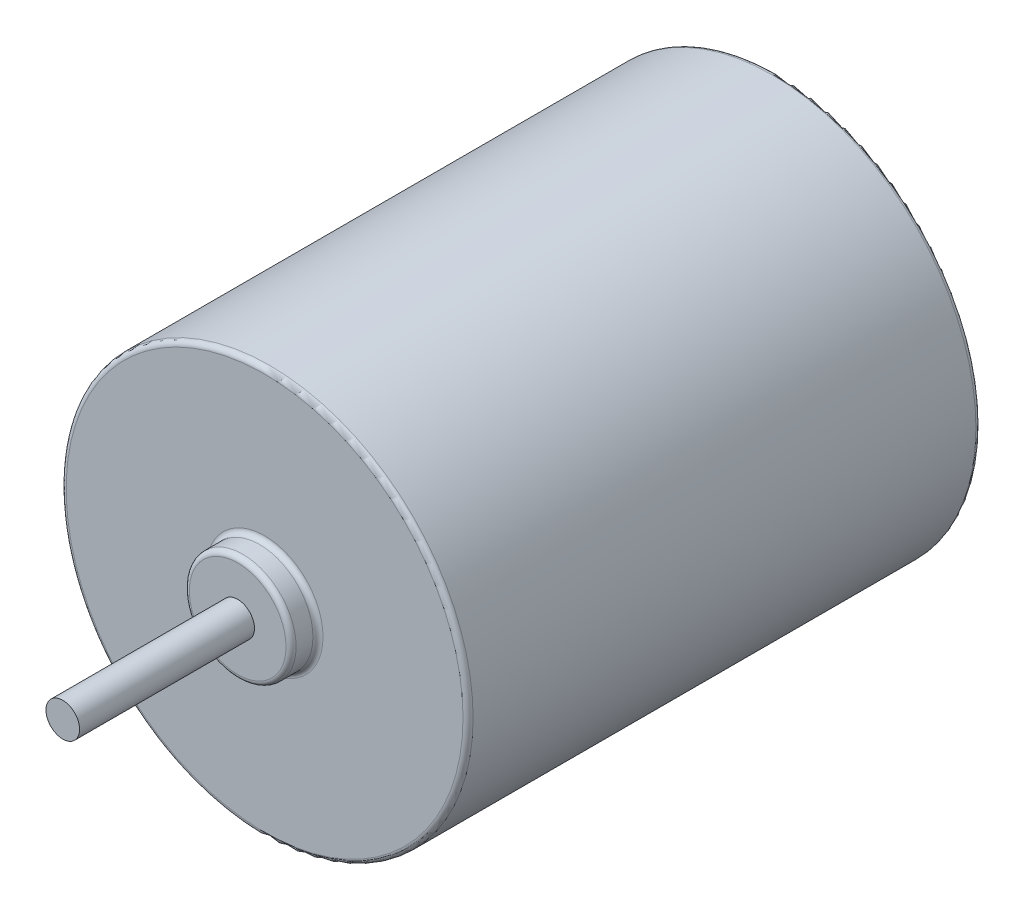
ISO-10303-21;
HEADER;
FILE_DESCRIPTION(('STEP AP214'),'2;1');
FILE_NAME('part.step','',(''),(''),'','','');
FILE_SCHEMA(('AUTOMOTIVE_DESIGN { 1 0 10303 214 1 1 1 1 }'));
ENDSEC;
DATA;
#1=APPLICATION_CONTEXT('core data for automotive mechanical design processes');
#2=APPLICATION_PROTOCOL_DEFINITION('international standard','automotive_design',2000,#1);
#3=PRODUCT_CONTEXT('',#1,'mechanical');
#4=PRODUCT('Part','Part','',(#3));
#5=PRODUCT_RELATED_PRODUCT_CATEGORY('part','',(#4));
#6=PRODUCT_DEFINITION_FORMATION('','',#4);
#7=PRODUCT_DEFINITION_CONTEXT('part definition',#1,'design');
#8=PRODUCT_DEFINITION('design','',#6,#7);
#9=PRODUCT_DEFINITION_SHAPE('','',#8);
#10=(LENGTH_UNIT() NAMED_UNIT(*) SI_UNIT(.MILLI.,.METRE.));
#11=(NAMED_UNIT(*) PLANE_ANGLE_UNIT() SI_UNIT($,.RADIAN.));
#12=(NAMED_UNIT(*) SI_UNIT($,.STERADIAN.) SOLID_ANGLE_UNIT());
#13=UNCERTAINTY_MEASURE_WITH_UNIT(LENGTH_MEASURE(1.E-05),#10,'distance_accuracy_value','');
#14=(GEOMETRIC_REPRESENTATION_CONTEXT(3) GLOBAL_UNCERTAINTY_ASSIGNED_CONTEXT((#13)) GLOBAL_UNIT_ASSIGNED_CONTEXT((#10,
#11,#12)) REPRESENTATION_CONTEXT('',''));
#15=CARTESIAN_POINT('',(0.,0.,0.));
#16=DIRECTION('',(0.,0.,1.));
#17=DIRECTION('',(1.,0.,0.));
#18=AXIS2_PLACEMENT_3D('',#15,#16,#17);
#19=CARTESIAN_POINT('',(0.,0.,-30.5));
#20=DIRECTION('',(0.,0.,1.));
#21=DIRECTION('',(1.,0.,0.));
#22=AXIS2_PLACEMENT_3D('',#19,#20,#21);
#23=CYLINDRICAL_SURFACE('',#22,12.1);
#24=CARTESIAN_POINT('',(0.,0.,-30.2));
#25=DIRECTION('',(0.,0.,1.));
#26=DIRECTION('',(1.,0.,0.));
#27=AXIS2_PLACEMENT_3D('',#24,#25,#26);
#28=CIRCLE('',#27,12.1);
#29=CARTESIAN_POINT('',(12.1,0.,-30.2));
#30=VERTEX_POINT('',#29);
#31=EDGE_CURVE('E66',#30,#30,#28,.T.);
#32=ORIENTED_EDGE('',*,*,#31,.T.);
#33=EDGE_LOOP('',(#32));
#34=FACE_BOUND('',#33,.T.);
#35=CARTESIAN_POINT('',(0.,0.,-0.300000000000002));
#36=DIRECTION('',(0.,0.,1.));
#37=DIRECTION('',(1.,0.,0.));
#38=AXIS2_PLACEMENT_3D('',#35,#36,#37);
#39=CIRCLE('',#38,12.1);
#40=CARTESIAN_POINT('',(12.1,0.,-0.300000000000002));
#41=VERTEX_POINT('',#40);
#42=EDGE_CURVE('E69',#41,#41,#39,.F.);
#43=ORIENTED_EDGE('',*,*,#42,.T.);
#44=EDGE_LOOP('',(#43));
#45=FACE_BOUND('',#44,.T.);
#46=ADVANCED_FACE('F34',(#34,#45),#23,.T.);
#47=CARTESIAN_POINT('',(0.,0.,-30.5));
#48=DIRECTION('',(0.,0.,1.));
#49=DIRECTION('',(1.,0.,0.));
#50=AXIS2_PLACEMENT_3D('',#47,#48,#49);
#51=PLANE('',#50);
#52=CARTESIAN_POINT('',(0.,0.,-30.5));
#53=DIRECTION('',(0.,0.,1.));
#54=DIRECTION('',(1.,0.,0.));
#55=AXIS2_PLACEMENT_3D('',#52,#53,#54);
#56=CIRCLE('',#55,11.8);
#57=CARTESIAN_POINT('',(11.8,0.,-30.5));
#58=VERTEX_POINT('',#57);
#59=EDGE_CURVE('E60',#58,#58,#56,.F.);
#60=ORIENTED_EDGE('',*,*,#59,.T.);
#61=EDGE_LOOP('',(#60));
#62=FACE_BOUND('',#61,.T.);
#63=CARTESIAN_POINT('',(0.,0.,-30.5));
#64=DIRECTION('',(0.,0.,1.));
#65=DIRECTION('',(1.,0.,0.));
#66=AXIS2_PLACEMENT_3D('',#63,#64,#65);
#67=CIRCLE('',#66,4.55);
#68=CARTESIAN_POINT('',(4.55,0.,-30.5));
#69=VERTEX_POINT('',#68);
#70=EDGE_CURVE('E63',#69,#69,#67,.T.);
#71=ORIENTED_EDGE('',*,*,#70,.T.);
#72=EDGE_LOOP('',(#71));
#73=FACE_BOUND('',#72,.T.);
#74=ADVANCED_FACE('F105',(#62,#73),#51,.F.);
#75=CARTESIAN_POINT('',(0.,0.,0.));
#76=DIRECTION('',(0.,0.,1.));
#77=DIRECTION('',(1.,0.,0.));
#78=AXIS2_PLACEMENT_3D('',#75,#76,#77);
#79=PLANE('',#78);
#80=CARTESIAN_POINT('',(0.,0.,0.));
#81=DIRECTION('',(0.,0.,1.));
#82=DIRECTION('',(1.,0.,0.));
#83=AXIS2_PLACEMENT_3D('',#80,#81,#82);
#84=CIRCLE('',#83,11.8);
#85=CARTESIAN_POINT('',(11.8,0.,0.));
#86=VERTEX_POINT('',#85);
#87=EDGE_CURVE('E10',#86,#86,#84,.T.);
#88=ORIENTED_EDGE('',*,*,#87,.T.);
#89=EDGE_LOOP('',(#88));
#90=FACE_BOUND('',#89,.T.);
#91=CARTESIAN_POINT('',(0.,0.,0.));
#92=DIRECTION('',(0.,0.,1.));
#93=DIRECTION('',(1.,0.,0.));
#94=AXIS2_PLACEMENT_3D('',#91,#92,#93);
#95=CIRCLE('',#94,3.475);
#96=CARTESIAN_POINT('',(3.475,0.,0.));
#97=VERTEX_POINT('',#96);
#98=EDGE_CURVE('E72',#97,#97,#95,.F.);
#99=ORIENTED_EDGE('',*,*,#98,.T.);
#100=EDGE_LOOP('',(#99));
#101=FACE_BOUND('',#100,.T.);
#102=ADVANCED_FACE('F101',(#90,#101),#79,.T.);
#103=CARTESIAN_POINT('',(0.,0.,1.6));
#104=DIRECTION('',(0.,0.,-1.));
#105=DIRECTION('',(-1.,0.,0.));
#106=AXIS2_PLACEMENT_3D('',#103,#104,#105);
#107=CYLINDRICAL_SURFACE('',#106,3.175);
#108=CARTESIAN_POINT('',(0.,0.,1.3));
#109=DIRECTION('',(0.,0.,1.));
#110=DIRECTION('',(1.,0.,0.));
#111=AXIS2_PLACEMENT_3D('',#108,#109,#110);
#112=CIRCLE('',#111,3.175);
#113=CARTESIAN_POINT('',(3.175,0.,1.3));
#114=VERTEX_POINT('',#113);
#115=EDGE_CURVE('E45',#114,#114,#112,.F.);
#116=ORIENTED_EDGE('',*,*,#115,.T.);
#117=EDGE_LOOP('',(#116));
#118=FACE_BOUND('',#117,.T.);
#119=CARTESIAN_POINT('',(0.,0.,0.3));
#120=DIRECTION('',(0.,0.,1.));
#121=DIRECTION('',(1.,0.,0.));
#122=AXIS2_PLACEMENT_3D('',#119,#120,#121);
#123=CIRCLE('',#122,3.175);
#124=CARTESIAN_POINT('',(3.175,0.,0.3));
#125=VERTEX_POINT('',#124);
#126=EDGE_CURVE('E75',#125,#125,#123,.T.);
#127=ORIENTED_EDGE('',*,*,#126,.T.);
#128=EDGE_LOOP('',(#127));
#129=FACE_BOUND('',#128,.T.);
#130=ADVANCED_FACE('F95',(#118,#129),#107,.T.);
#131=CARTESIAN_POINT('',(0.,0.,1.6));
#132=DIRECTION('',(0.,0.,1.));
#133=DIRECTION('',(1.,0.,0.));
#134=AXIS2_PLACEMENT_3D('',#131,#132,#133);
#135=PLANE('',#134);
#136=CARTESIAN_POINT('',(0.,0.,1.6));
#137=DIRECTION('',(0.,0.,1.));
#138=DIRECTION('',(1.,0.,0.));
#139=AXIS2_PLACEMENT_3D('',#136,#137,#138);
#140=CIRCLE('',#139,2.875);
#141=CARTESIAN_POINT('',(2.875,0.,1.6));
#142=VERTEX_POINT('',#141);
#143=EDGE_CURVE('E49',#142,#142,#140,.T.);
#144=ORIENTED_EDGE('',*,*,#143,.T.);
#145=EDGE_LOOP('',(#144));
#146=FACE_BOUND('',#145,.T.);
#147=CARTESIAN_POINT('',(0.,0.,1.6));
#148=DIRECTION('',(0.,0.,1.));
#149=DIRECTION('',(1.,0.,0.));
#150=AXIS2_PLACEMENT_3D('',#147,#148,#149);
#151=CIRCLE('',#150,1.);
#152=CARTESIAN_POINT('',(1.,0.,1.6));
#153=VERTEX_POINT('',#152);
#154=EDGE_CURVE('E78',#153,#153,#151,.T.);
#155=ORIENTED_EDGE('',*,*,#154,.F.);
#156=EDGE_LOOP('',(#155));
#157=FACE_BOUND('',#156,.T.);
#158=ADVANCED_FACE('F90',(#146,#157),#135,.T.);
#159=CARTESIAN_POINT('',(0.,0.,12.));
#160=DIRECTION('',(0.,0.,-1.));
#161=DIRECTION('',(-1.,0.,0.));
#162=AXIS2_PLACEMENT_3D('',#159,#160,#161);
#163=CYLINDRICAL_SURFACE('',#162,1.);
#164=CARTESIAN_POINT('',(0.,0.,12.));
#165=DIRECTION('',(0.,0.,1.));
#166=DIRECTION('',(1.,0.,0.));
#167=AXIS2_PLACEMENT_3D('',#164,#165,#166);
#168=CIRCLE('',#167,1.);
#169=CARTESIAN_POINT('',(1.,0.,12.));
#170=VERTEX_POINT('',#169);
#171=EDGE_CURVE('E81',#170,#170,#168,.T.);
#172=ORIENTED_EDGE('',*,*,#171,.F.);
#173=EDGE_LOOP('',(#172));
#174=FACE_BOUND('',#173,.T.);
#175=ORIENTED_EDGE('',*,*,#154,.T.);
#176=EDGE_LOOP('',(#175));
#177=FACE_BOUND('',#176,.T.);
#178=ADVANCED_FACE('F87',(#174,#177),#163,.T.);
#179=CARTESIAN_POINT('',(0.,0.,12.));
#180=DIRECTION('',(0.,0.,1.));
#181=DIRECTION('',(1.,0.,0.));
#182=AXIS2_PLACEMENT_3D('',#179,#180,#181);
#183=PLANE('',#182);
#184=ORIENTED_EDGE('',*,*,#171,.T.);
#185=EDGE_LOOP('',(#184));
#186=FACE_BOUND('',#185,.T.);
#187=ADVANCED_FACE('F85',(#186),#183,.T.);
#188=CARTESIAN_POINT('',(0.,0.,-32.5));
#189=DIRECTION('',(0.,0.,1.));
#190=DIRECTION('',(1.,0.,0.));
#191=AXIS2_PLACEMENT_3D('',#188,#189,#190);
#192=CYLINDRICAL_SURFACE('',#191,4.25);
#193=CARTESIAN_POINT('',(0.,0.,-30.8));
#194=DIRECTION('',(0.,0.,1.));
#195=DIRECTION('',(1.,0.,0.));
#196=AXIS2_PLACEMENT_3D('',#193,#194,#195);
#197=CIRCLE('',#196,4.25);
#198=CARTESIAN_POINT('',(4.25,0.,-30.8));
#199=VERTEX_POINT('',#198);
#200=EDGE_CURVE('E54',#199,#199,#197,.F.);
#201=ORIENTED_EDGE('',*,*,#200,.T.);
#202=EDGE_LOOP('',(#201));
#203=FACE_BOUND('',#202,.T.);
#204=CARTESIAN_POINT('',(0.,0.,-32.2));
#205=DIRECTION('',(0.,0.,-1.));
#206=DIRECTION('',(-1.,0.,0.));
#207=AXIS2_PLACEMENT_3D('',#204,#205,#206);
#208=CIRCLE('',#207,4.25);
#209=CARTESIAN_POINT('',(-4.25,0.,-32.2));
#210=VERTEX_POINT('',#209);
#211=EDGE_CURVE('E57',#210,#210,#208,.F.);
#212=ORIENTED_EDGE('',*,*,#211,.T.);
#213=EDGE_LOOP('',(#212));
#214=FACE_BOUND('',#213,.T.);
#215=ADVANCED_FACE('F142',(#203,#214),#192,.T.);
#216=CARTESIAN_POINT('',(0.,0.,-32.5));
#217=DIRECTION('',(0.,0.,-1.));
#218=DIRECTION('',(-1.,0.,0.));
#219=AXIS2_PLACEMENT_3D('',#216,#217,#218);
#220=PLANE('',#219);
#221=CARTESIAN_POINT('',(0.,0.,-32.5));
#222=DIRECTION('',(0.,0.,-1.));
#223=DIRECTION('',(-1.,0.,0.));
#224=AXIS2_PLACEMENT_3D('',#221,#222,#223);
#225=CIRCLE('',#224,3.95);
#226=CARTESIAN_POINT('',(-3.95,0.,-32.5));
#227=VERTEX_POINT('',#226);
#228=EDGE_CURVE('E41',#227,#227,#225,.T.);
#229=ORIENTED_EDGE('',*,*,#228,.T.);
#230=EDGE_LOOP('',(#229));
#231=FACE_BOUND('',#230,.T.);
#232=ADVANCED_FACE('F120',(#231),#220,.T.);
#233=CARTESIAN_POINT('',(0.,0.,0.3));
#234=DIRECTION('',(0.,0.,1.));
#235=DIRECTION('',(1.,0.,0.));
#236=AXIS2_PLACEMENT_3D('',#233,#234,#235);
#237=TOROIDAL_SURFACE('',#236,3.475,0.3);
#238=ORIENTED_EDGE('',*,*,#98,.F.);
#239=EDGE_LOOP('',(#238));
#240=FACE_BOUND('',#239,.T.);
#241=ORIENTED_EDGE('',*,*,#126,.F.);
#242=EDGE_LOOP('',(#241));
#243=FACE_BOUND('',#242,.T.);
#244=ADVANCED_FACE('F116',(#240,#243),#237,.F.);
#245=CARTESIAN_POINT('',(0.,0.,-30.2));
#246=DIRECTION('',(0.,0.,1.));
#247=DIRECTION('',(1.,0.,0.));
#248=AXIS2_PLACEMENT_3D('',#245,#246,#247);
#249=TOROIDAL_SURFACE('',#248,11.8,0.3);
#250=ORIENTED_EDGE('',*,*,#59,.F.);
#251=EDGE_LOOP('',(#250));
#252=FACE_BOUND('',#251,.T.);
#253=ORIENTED_EDGE('',*,*,#31,.F.);
#254=EDGE_LOOP('',(#253));
#255=FACE_BOUND('',#254,.T.);
#256=ADVANCED_FACE('F119',(#252,#255),#249,.T.);
#257=CARTESIAN_POINT('',(0.,0.,-30.8));
#258=DIRECTION('',(0.,0.,1.));
#259=DIRECTION('',(1.,0.,0.));
#260=AXIS2_PLACEMENT_3D('',#257,#258,#259);
#261=TOROIDAL_SURFACE('',#260,4.55,0.3);
#262=ORIENTED_EDGE('',*,*,#70,.F.);
#263=EDGE_LOOP('',(#262));
#264=FACE_BOUND('',#263,.T.);
#265=ORIENTED_EDGE('',*,*,#200,.F.);
#266=EDGE_LOOP('',(#265));
#267=FACE_BOUND('',#266,.T.);
#268=ADVANCED_FACE('F124',(#264,#267),#261,.F.);
#269=CARTESIAN_POINT('',(0.,0.,1.3));
#270=DIRECTION('',(0.,0.,1.));
#271=DIRECTION('',(1.,0.,0.));
#272=AXIS2_PLACEMENT_3D('',#269,#270,#271);
#273=TOROIDAL_SURFACE('',#272,2.875,0.3);
#274=ORIENTED_EDGE('',*,*,#115,.F.);
#275=EDGE_LOOP('',(#274));
#276=FACE_BOUND('',#275,.T.);
#277=ORIENTED_EDGE('',*,*,#143,.F.);
#278=EDGE_LOOP('',(#277));
#279=FACE_BOUND('',#278,.T.);
#280=ADVANCED_FACE('F128',(#276,#279),#273,.T.);
#281=CARTESIAN_POINT('',(0.,0.,-32.2));
#282=DIRECTION('',(0.,0.,-1.));
#283=DIRECTION('',(-1.,0.,0.));
#284=AXIS2_PLACEMENT_3D('',#281,#282,#283);
#285=TOROIDAL_SURFACE('',#284,3.95,0.3);
#286=ORIENTED_EDGE('',*,*,#211,.F.);
#287=EDGE_LOOP('',(#286));
#288=FACE_BOUND('',#287,.T.);
#289=ORIENTED_EDGE('',*,*,#228,.F.);
#290=EDGE_LOOP('',(#289));
#291=FACE_BOUND('',#290,.T.);
#292=ADVANCED_FACE('F131',(#288,#291),#285,.T.);
#293=CARTESIAN_POINT('',(0.,0.,-0.300000000000002));
#294=DIRECTION('',(0.,0.,1.));
#295=DIRECTION('',(1.,0.,0.));
#296=AXIS2_PLACEMENT_3D('',#293,#294,#295);
#297=TOROIDAL_SURFACE('',#296,11.8,0.3);
#298=ORIENTED_EDGE('',*,*,#42,.F.);
#299=EDGE_LOOP('',(#298));
#300=FACE_BOUND('',#299,.T.);
#301=ORIENTED_EDGE('',*,*,#87,.F.);
#302=EDGE_LOOP('',(#301));
#303=FACE_BOUND('',#302,.T.);
#304=ADVANCED_FACE('F36',(#300,#303),#297,.T.);
#305=CLOSED_SHELL('',(#46,#74,#102,#130,#158,#178,#187,#215,#232,#244,#256,#268,#280,#292,#304));
#306=MANIFOLD_SOLID_BREP('B2',#305);
#307=ADVANCED_BREP_SHAPE_REPRESENTATION('',(#18,#306),#14);
#308=SHAPE_DEFINITION_REPRESENTATION(#9,#307);
ENDSEC;
END-ISO-10303-21;
